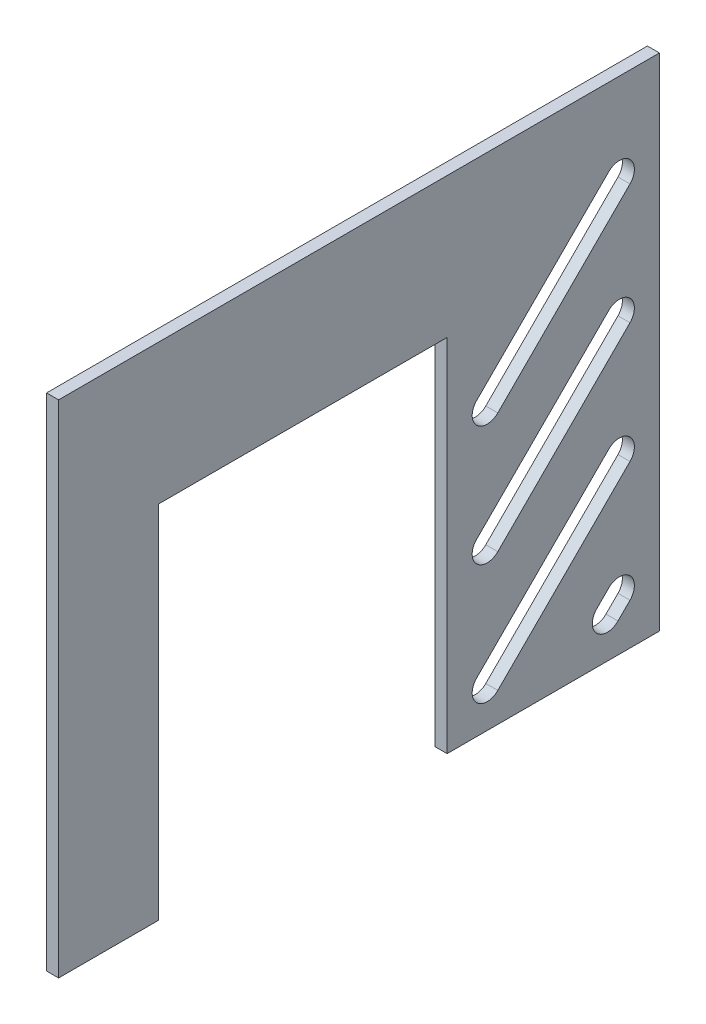
ISO-10303-21;
HEADER;
FILE_DESCRIPTION(('STEP AP214'),'2;1');
FILE_NAME('part.step','',(''),(''),'','','');
FILE_SCHEMA(('AUTOMOTIVE_DESIGN { 1 0 10303 214 1 1 1 1 }'));
ENDSEC;
DATA;
#1=APPLICATION_CONTEXT('core data for automotive mechanical design processes');
#2=APPLICATION_PROTOCOL_DEFINITION('international standard','automotive_design',2000,#1);
#3=PRODUCT_CONTEXT('',#1,'mechanical');
#4=PRODUCT('Part','Part','',(#3));
#5=PRODUCT_RELATED_PRODUCT_CATEGORY('part','',(#4));
#6=PRODUCT_DEFINITION_FORMATION('','',#4);
#7=PRODUCT_DEFINITION_CONTEXT('part definition',#1,'design');
#8=PRODUCT_DEFINITION('design','',#6,#7);
#9=PRODUCT_DEFINITION_SHAPE('','',#8);
#10=(LENGTH_UNIT() NAMED_UNIT(*) SI_UNIT(.MILLI.,.METRE.));
#11=(NAMED_UNIT(*) PLANE_ANGLE_UNIT() SI_UNIT($,.RADIAN.));
#12=(NAMED_UNIT(*) SI_UNIT($,.STERADIAN.) SOLID_ANGLE_UNIT());
#13=UNCERTAINTY_MEASURE_WITH_UNIT(LENGTH_MEASURE(1.E-05),#10,'distance_accuracy_value','');
#14=(GEOMETRIC_REPRESENTATION_CONTEXT(3) GLOBAL_UNCERTAINTY_ASSIGNED_CONTEXT((#13)) GLOBAL_UNIT_ASSIGNED_CONTEXT((#10,
#11,#12)) REPRESENTATION_CONTEXT('',''));
#15=CARTESIAN_POINT('',(0.,0.,0.));
#16=DIRECTION('',(0.,0.,1.));
#17=DIRECTION('',(1.,0.,0.));
#18=AXIS2_PLACEMENT_3D('',#15,#16,#17);
#19=CARTESIAN_POINT('',(6.,0.,0.));
#20=DIRECTION('',(0.,-1.,0.));
#21=DIRECTION('',(0.,0.,-1.));
#22=AXIS2_PLACEMENT_3D('',#19,#20,#21);
#23=PLANE('',#22);
#24=DIRECTION('',(0.,0.,1.));
#25=VECTOR('',#24,1.);
#26=CARTESIAN_POINT('',(0.,0.,0.));
#27=LINE('',#26,#25);
#28=CARTESIAN_POINT('',(0.,0.,-300.));
#29=VERTEX_POINT('',#28);
#30=CARTESIAN_POINT('',(0.,0.,-194.));
#31=VERTEX_POINT('',#30);
#32=EDGE_CURVE('E315',#29,#31,#27,.T.);
#33=ORIENTED_EDGE('',*,*,#32,.F.);
#34=DIRECTION('',(-1.,0.,0.));
#35=VECTOR('',#34,1.);
#36=CARTESIAN_POINT('',(6.,0.,-300.));
#37=LINE('',#36,#35);
#38=CARTESIAN_POINT('',(6.,0.,-300.));
#39=VERTEX_POINT('',#38);
#40=EDGE_CURVE('E11',#39,#29,#37,.T.);
#41=ORIENTED_EDGE('',*,*,#40,.F.);
#42=DIRECTION('',(0.,0.,1.));
#43=VECTOR('',#42,1.);
#44=CARTESIAN_POINT('',(6.,0.,0.));
#45=LINE('',#44,#43);
#46=CARTESIAN_POINT('',(6.,0.,-194.));
#47=VERTEX_POINT('',#46);
#48=EDGE_CURVE('E316',#39,#47,#45,.T.);
#49=ORIENTED_EDGE('',*,*,#48,.T.);
#50=DIRECTION('',(-1.,0.,0.));
#51=VECTOR('',#50,1.);
#52=CARTESIAN_POINT('',(6.,0.,-194.));
#53=LINE('',#52,#51);
#54=EDGE_CURVE('E339',#47,#31,#53,.T.);
#55=ORIENTED_EDGE('',*,*,#54,.T.);
#56=EDGE_LOOP('',(#33,#41,#49,#55));
#57=FACE_BOUND('',#56,.T.);
#58=ADVANCED_FACE('F40',(#57),#23,.T.);
#59=CARTESIAN_POINT('',(6.,0.,-300.));
#60=DIRECTION('',(0.,0.,1.));
#61=DIRECTION('',(1.,0.,0.));
#62=AXIS2_PLACEMENT_3D('',#59,#60,#61);
#63=PLANE('',#62);
#64=DIRECTION('',(-1.,0.,0.));
#65=VECTOR('',#64,1.);
#66=CARTESIAN_POINT('',(6.,250.,-300.));
#67=LINE('',#66,#65);
#68=CARTESIAN_POINT('',(6.,250.,-300.));
#69=VERTEX_POINT('',#68);
#70=CARTESIAN_POINT('',(0.,250.,-300.));
#71=VERTEX_POINT('',#70);
#72=EDGE_CURVE('E47',#69,#71,#67,.T.);
#73=ORIENTED_EDGE('',*,*,#72,.F.);
#74=DIRECTION('',(0.,1.,0.));
#75=VECTOR('',#74,1.);
#76=CARTESIAN_POINT('',(6.,0.,-300.));
#77=LINE('',#76,#75);
#78=EDGE_CURVE('E319',#39,#69,#77,.T.);
#79=ORIENTED_EDGE('',*,*,#78,.F.);
#80=ORIENTED_EDGE('',*,*,#40,.T.);
#81=DIRECTION('',(0.,1.,0.));
#82=VECTOR('',#81,1.);
#83=CARTESIAN_POINT('',(0.,0.,-300.));
#84=LINE('',#83,#82);
#85=EDGE_CURVE('E342',#29,#71,#84,.T.);
#86=ORIENTED_EDGE('',*,*,#85,.T.);
#87=EDGE_LOOP('',(#73,#79,#80,#86));
#88=FACE_BOUND('',#87,.T.);
#89=ADVANCED_FACE('F394',(#88),#63,.F.);
#90=CARTESIAN_POINT('',(6.,250.,0.));
#91=DIRECTION('',(0.,1.,0.));
#92=DIRECTION('',(0.,0.,1.));
#93=AXIS2_PLACEMENT_3D('',#90,#91,#92);
#94=PLANE('',#93);
#95=DIRECTION('',(0.,0.,-1.));
#96=VECTOR('',#95,1.);
#97=CARTESIAN_POINT('',(0.,250.,0.));
#98=LINE('',#97,#96);
#99=CARTESIAN_POINT('',(0.,250.,0.));
#100=VERTEX_POINT('',#99);
#101=EDGE_CURVE('E344',#100,#71,#98,.T.);
#102=ORIENTED_EDGE('',*,*,#101,.F.);
#103=DIRECTION('',(-1.,0.,0.));
#104=VECTOR('',#103,1.);
#105=CARTESIAN_POINT('',(6.,250.,0.));
#106=LINE('',#105,#104);
#107=CARTESIAN_POINT('',(6.,250.,0.));
#108=VERTEX_POINT('',#107);
#109=EDGE_CURVE('E373',#108,#100,#106,.T.);
#110=ORIENTED_EDGE('',*,*,#109,.F.);
#111=DIRECTION('',(0.,0.,-1.));
#112=VECTOR('',#111,1.);
#113=CARTESIAN_POINT('',(6.,250.,0.));
#114=LINE('',#113,#112);
#115=EDGE_CURVE('E322',#108,#69,#114,.T.);
#116=ORIENTED_EDGE('',*,*,#115,.T.);
#117=ORIENTED_EDGE('',*,*,#72,.T.);
#118=EDGE_LOOP('',(#102,#110,#116,#117));
#119=FACE_BOUND('',#118,.T.);
#120=ADVANCED_FACE('F378',(#119),#94,.T.);
#121=CARTESIAN_POINT('',(6.,0.,0.));
#122=DIRECTION('',(0.,0.,1.));
#123=DIRECTION('',(1.,0.,0.));
#124=AXIS2_PLACEMENT_3D('',#121,#122,#123);
#125=PLANE('',#124);
#126=DIRECTION('',(0.,1.,0.));
#127=VECTOR('',#126,1.);
#128=CARTESIAN_POINT('',(0.,0.,0.));
#129=LINE('',#128,#127);
#130=CARTESIAN_POINT('',(0.,0.,0.));
#131=VERTEX_POINT('',#130);
#132=EDGE_CURVE('E347',#131,#100,#129,.T.);
#133=ORIENTED_EDGE('',*,*,#132,.F.);
#134=DIRECTION('',(-1.,0.,0.));
#135=VECTOR('',#134,1.);
#136=CARTESIAN_POINT('',(6.,0.,0.));
#137=LINE('',#136,#135);
#138=CARTESIAN_POINT('',(6.,0.,0.));
#139=VERTEX_POINT('',#138);
#140=EDGE_CURVE('E371',#139,#131,#137,.T.);
#141=ORIENTED_EDGE('',*,*,#140,.F.);
#142=DIRECTION('',(0.,1.,0.));
#143=VECTOR('',#142,1.);
#144=CARTESIAN_POINT('',(6.,0.,0.));
#145=LINE('',#144,#143);
#146=EDGE_CURVE('E325',#139,#108,#145,.T.);
#147=ORIENTED_EDGE('',*,*,#146,.T.);
#148=ORIENTED_EDGE('',*,*,#109,.T.);
#149=EDGE_LOOP('',(#133,#141,#147,#148));
#150=FACE_BOUND('',#149,.T.);
#151=ADVANCED_FACE('F389',(#150),#125,.T.);
#152=CARTESIAN_POINT('',(6.,0.,0.));
#153=DIRECTION('',(0.,1.,0.));
#154=DIRECTION('',(0.,0.,1.));
#155=AXIS2_PLACEMENT_3D('',#152,#153,#154);
#156=PLANE('',#155);
#157=DIRECTION('',(0.,0.,-1.));
#158=VECTOR('',#157,1.);
#159=CARTESIAN_POINT('',(0.,0.,0.));
#160=LINE('',#159,#158);
#161=CARTESIAN_POINT('',(0.,0.,-50.));
#162=VERTEX_POINT('',#161);
#163=EDGE_CURVE('E350',#131,#162,#160,.T.);
#164=ORIENTED_EDGE('',*,*,#163,.T.);
#165=DIRECTION('',(-1.,0.,0.));
#166=VECTOR('',#165,1.);
#167=CARTESIAN_POINT('',(6.,0.,-50.));
#168=LINE('',#167,#166);
#169=CARTESIAN_POINT('',(6.,0.,-50.));
#170=VERTEX_POINT('',#169);
#171=EDGE_CURVE('E368',#170,#162,#168,.T.);
#172=ORIENTED_EDGE('',*,*,#171,.F.);
#173=DIRECTION('',(0.,0.,-1.));
#174=VECTOR('',#173,1.);
#175=CARTESIAN_POINT('',(6.,0.,0.));
#176=LINE('',#175,#174);
#177=EDGE_CURVE('E328',#139,#170,#176,.T.);
#178=ORIENTED_EDGE('',*,*,#177,.F.);
#179=ORIENTED_EDGE('',*,*,#140,.T.);
#180=EDGE_LOOP('',(#164,#172,#178,#179));
#181=FACE_BOUND('',#180,.T.);
#182=ADVANCED_FACE('F407',(#181),#156,.F.);
#183=CARTESIAN_POINT('',(6.,0.,-50.));
#184=DIRECTION('',(0.,0.,1.));
#185=DIRECTION('',(1.,0.,0.));
#186=AXIS2_PLACEMENT_3D('',#183,#184,#185);
#187=PLANE('',#186);
#188=DIRECTION('',(0.,1.,0.));
#189=VECTOR('',#188,1.);
#190=CARTESIAN_POINT('',(0.,0.,-50.));
#191=LINE('',#190,#189);
#192=CARTESIAN_POINT('',(0.,180.,-50.));
#193=VERTEX_POINT('',#192);
#194=EDGE_CURVE('E353',#162,#193,#191,.T.);
#195=ORIENTED_EDGE('',*,*,#194,.T.);
#196=DIRECTION('',(-1.,0.,0.));
#197=VECTOR('',#196,1.);
#198=CARTESIAN_POINT('',(6.,180.,-50.));
#199=LINE('',#198,#197);
#200=CARTESIAN_POINT('',(6.,180.,-50.));
#201=VERTEX_POINT('',#200);
#202=EDGE_CURVE('E365',#201,#193,#199,.T.);
#203=ORIENTED_EDGE('',*,*,#202,.F.);
#204=DIRECTION('',(0.,1.,0.));
#205=VECTOR('',#204,1.);
#206=CARTESIAN_POINT('',(6.,0.,-50.));
#207=LINE('',#206,#205);
#208=EDGE_CURVE('E331',#170,#201,#207,.T.);
#209=ORIENTED_EDGE('',*,*,#208,.F.);
#210=ORIENTED_EDGE('',*,*,#171,.T.);
#211=EDGE_LOOP('',(#195,#203,#209,#210));
#212=FACE_BOUND('',#211,.T.);
#213=ADVANCED_FACE('F404',(#212),#187,.F.);
#214=CARTESIAN_POINT('',(6.,180.,0.));
#215=DIRECTION('',(0.,1.,0.));
#216=DIRECTION('',(0.,0.,1.));
#217=AXIS2_PLACEMENT_3D('',#214,#215,#216);
#218=PLANE('',#217);
#219=DIRECTION('',(0.,0.,-1.));
#220=VECTOR('',#219,1.);
#221=CARTESIAN_POINT('',(0.,180.,0.));
#222=LINE('',#221,#220);
#223=CARTESIAN_POINT('',(0.,180.,-194.));
#224=VERTEX_POINT('',#223);
#225=EDGE_CURVE('E356',#193,#224,#222,.T.);
#226=ORIENTED_EDGE('',*,*,#225,.T.);
#227=DIRECTION('',(-1.,0.,0.));
#228=VECTOR('',#227,1.);
#229=CARTESIAN_POINT('',(6.,180.,-194.));
#230=LINE('',#229,#228);
#231=CARTESIAN_POINT('',(6.,180.,-194.));
#232=VERTEX_POINT('',#231);
#233=EDGE_CURVE('E362',#232,#224,#230,.T.);
#234=ORIENTED_EDGE('',*,*,#233,.F.);
#235=DIRECTION('',(0.,0.,-1.));
#236=VECTOR('',#235,1.);
#237=CARTESIAN_POINT('',(6.,180.,0.));
#238=LINE('',#237,#236);
#239=EDGE_CURVE('E334',#201,#232,#238,.T.);
#240=ORIENTED_EDGE('',*,*,#239,.F.);
#241=ORIENTED_EDGE('',*,*,#202,.T.);
#242=EDGE_LOOP('',(#226,#234,#240,#241));
#243=FACE_BOUND('',#242,.T.);
#244=ADVANCED_FACE('F401',(#243),#218,.F.);
#245=CARTESIAN_POINT('',(6.,0.,-194.));
#246=DIRECTION('',(0.,0.,-1.));
#247=DIRECTION('',(0.,1.,0.));
#248=AXIS2_PLACEMENT_3D('',#245,#246,#247);
#249=PLANE('',#248);
#250=DIRECTION('',(0.,-1.,0.));
#251=VECTOR('',#250,1.);
#252=CARTESIAN_POINT('',(0.,0.,-194.));
#253=LINE('',#252,#251);
#254=EDGE_CURVE('E320',#224,#31,#253,.T.);
#255=ORIENTED_EDGE('',*,*,#254,.T.);
#256=ORIENTED_EDGE('',*,*,#54,.F.);
#257=DIRECTION('',(0.,-1.,0.));
#258=VECTOR('',#257,1.);
#259=CARTESIAN_POINT('',(6.,0.,-194.));
#260=LINE('',#259,#258);
#261=EDGE_CURVE('E337',#232,#47,#260,.T.);
#262=ORIENTED_EDGE('',*,*,#261,.F.);
#263=ORIENTED_EDGE('',*,*,#233,.T.);
#264=EDGE_LOOP('',(#255,#256,#262,#263));
#265=FACE_BOUND('',#264,.T.);
#266=ADVANCED_FACE('F399',(#265),#249,.F.);
#267=CARTESIAN_POINT('',(6.,0.,0.));
#268=DIRECTION('',(1.,0.,0.));
#269=DIRECTION('',(0.,0.,-1.));
#270=AXIS2_PLACEMENT_3D('',#267,#268,#269);
#271=PLANE('',#270);
#272=CARTESIAN_POINT('',(6.,140.,-214.));
#273=DIRECTION('',(1.,0.,0.));
#274=DIRECTION('',(0.,0.,-1.));
#275=AXIS2_PLACEMENT_3D('',#272,#273,#274);
#276=CIRCLE('',#275,7.50000000000002);
#277=CARTESIAN_POINT('',(6.,145.303300858899,-208.696699141101));
#278=VERTEX_POINT('',#277);
#279=CARTESIAN_POINT('',(6.,134.696699141101,-219.303300858899));
#280=VERTEX_POINT('',#279);
#281=EDGE_CURVE('E212',#278,#280,#276,.T.);
#282=ORIENTED_EDGE('',*,*,#281,.F.);
#283=DIRECTION('',(0.,-0.707106781186547,0.707106781186548));
#284=VECTOR('',#283,1.);
#285=CARTESIAN_POINT('',(6.,28.3033008588991,-91.6966991411008));
#286=LINE('',#285,#284);
#287=CARTESIAN_POINT('',(6.,211.303300858899,-274.696699141101));
#288=VERTEX_POINT('',#287);
#289=EDGE_CURVE('E201',#288,#278,#286,.T.);
#290=ORIENTED_EDGE('',*,*,#289,.F.);
#291=CARTESIAN_POINT('',(6.,206.,-280.));
#292=DIRECTION('',(1.,0.,0.));
#293=DIRECTION('',(0.,0.,-1.));
#294=AXIS2_PLACEMENT_3D('',#291,#292,#293);
#295=CIRCLE('',#294,7.5);
#296=CARTESIAN_POINT('',(6.,200.696699141101,-285.303300858899));
#297=VERTEX_POINT('',#296);
#298=EDGE_CURVE('E54',#297,#288,#295,.T.);
#299=ORIENTED_EDGE('',*,*,#298,.F.);
#300=DIRECTION('',(0.,0.707106781186548,-0.707106781186548));
#301=VECTOR('',#300,1.);
#302=CARTESIAN_POINT('',(6.,17.6966991411009,-102.303300858899));
#303=LINE('',#302,#301);
#304=EDGE_CURVE('E218',#280,#297,#303,.T.);
#305=ORIENTED_EDGE('',*,*,#304,.F.);
#306=EDGE_LOOP('',(#282,#290,#299,#305));
#307=FACE_BOUND('',#306,.T.);
#308=DIRECTION('',(0.,0.707106781186549,-0.707106781186546));
#309=VECTOR('',#308,1.);
#310=CARTESIAN_POINT('',(6.,-12.3033008588991,-132.3033008589));
#311=LINE('',#310,#309);
#312=CARTESIAN_POINT('',(6.,74.6966991411009,-219.303300858899));
#313=VERTEX_POINT('',#312);
#314=CARTESIAN_POINT('',(6.,140.696699141101,-285.303300858899));
#315=VERTEX_POINT('',#314);
#316=EDGE_CURVE('E252',#313,#315,#311,.T.);
#317=ORIENTED_EDGE('',*,*,#316,.F.);
#318=CARTESIAN_POINT('',(6.,80.,-214.));
#319=DIRECTION('',(1.,0.,0.));
#320=DIRECTION('',(0.,0.,-1.));
#321=AXIS2_PLACEMENT_3D('',#318,#319,#320);
#322=CIRCLE('',#321,7.50000000000002);
#323=CARTESIAN_POINT('',(6.,85.3033008588991,-208.696699141101));
#324=VERTEX_POINT('',#323);
#325=EDGE_CURVE('E232',#324,#313,#322,.T.);
#326=ORIENTED_EDGE('',*,*,#325,.F.);
#327=DIRECTION('',(0.,-0.707106781186549,0.707106781186546));
#328=VECTOR('',#327,1.);
#329=CARTESIAN_POINT('',(6.,-1.69669914110089,-121.696699141101));
#330=LINE('',#329,#328);
#331=CARTESIAN_POINT('',(6.,151.303300858899,-274.696699141101));
#332=VERTEX_POINT('',#331);
#333=EDGE_CURVE('E238',#332,#324,#330,.T.);
#334=ORIENTED_EDGE('',*,*,#333,.F.);
#335=CARTESIAN_POINT('',(6.,146.,-280.));
#336=DIRECTION('',(1.,0.,0.));
#337=DIRECTION('',(0.,0.,-1.));
#338=AXIS2_PLACEMENT_3D('',#335,#336,#337);
#339=CIRCLE('',#338,7.50000000000006);
#340=EDGE_CURVE('E245',#315,#332,#339,.T.);
#341=ORIENTED_EDGE('',*,*,#340,.F.);
#342=EDGE_LOOP('',(#317,#326,#334,#341));
#343=FACE_BOUND('',#342,.T.);
#344=CARTESIAN_POINT('',(6.,20.,-274.));
#345=DIRECTION('',(1.,0.,0.));
#346=DIRECTION('',(0.,0.,-1.));
#347=AXIS2_PLACEMENT_3D('',#344,#345,#346);
#348=CIRCLE('',#347,7.50000000000006);
#349=CARTESIAN_POINT('',(6.,25.3033008588992,-268.696699141101));
#350=VERTEX_POINT('',#349);
#351=CARTESIAN_POINT('',(6.,14.6966991411009,-279.303300858899));
#352=VERTEX_POINT('',#351);
#353=EDGE_CURVE('E313',#350,#352,#348,.T.);
#354=ORIENTED_EDGE('',*,*,#353,.F.);
#355=DIRECTION('',(0.,-0.707106781186549,0.707106781186546));
#356=VECTOR('',#355,1.);
#357=CARTESIAN_POINT('',(6.,-121.696699141101,-121.696699141101));
#358=LINE('',#357,#356);
#359=CARTESIAN_POINT('',(6.,31.3033008588992,-274.696699141101));
#360=VERTEX_POINT('',#359);
#361=EDGE_CURVE('E306',#360,#350,#358,.T.);
#362=ORIENTED_EDGE('',*,*,#361,.F.);
#363=CARTESIAN_POINT('',(6.,26.,-280.));
#364=DIRECTION('',(1.,0.,0.));
#365=DIRECTION('',(0.,0.,-1.));
#366=AXIS2_PLACEMENT_3D('',#363,#364,#365);
#367=CIRCLE('',#366,7.50000000000006);
#368=CARTESIAN_POINT('',(6.,20.6966991411009,-285.303300858899));
#369=VERTEX_POINT('',#368);
#370=EDGE_CURVE('E308',#369,#360,#367,.T.);
#371=ORIENTED_EDGE('',*,*,#370,.F.);
#372=DIRECTION('',(0.,0.707106781186549,-0.707106781186546));
#373=VECTOR('',#372,1.);
#374=CARTESIAN_POINT('',(6.,-132.303300858899,-132.3033008589));
#375=LINE('',#374,#373);
#376=EDGE_CURVE('E311',#352,#369,#375,.T.);
#377=ORIENTED_EDGE('',*,*,#376,.F.);
#378=EDGE_LOOP('',(#354,#362,#371,#377));
#379=FACE_BOUND('',#378,.T.);
#380=CARTESIAN_POINT('',(6.,20.,-214.));
#381=DIRECTION('',(1.,0.,0.));
#382=DIRECTION('',(0.,0.,-1.));
#383=AXIS2_PLACEMENT_3D('',#380,#381,#382);
#384=CIRCLE('',#383,7.50000000000002);
#385=CARTESIAN_POINT('',(6.,25.3033008588991,-208.696699141101));
#386=VERTEX_POINT('',#385);
#387=CARTESIAN_POINT('',(6.,14.6966991411009,-219.303300858899));
#388=VERTEX_POINT('',#387);
#389=EDGE_CURVE('E304',#386,#388,#384,.T.);
#390=ORIENTED_EDGE('',*,*,#389,.F.);
#391=DIRECTION('',(0.,-0.707106781186547,0.707106781186548));
#392=VECTOR('',#391,1.);
#393=CARTESIAN_POINT('',(6.,-91.6966991411009,-91.6966991411008));
#394=LINE('',#393,#392);
#395=CARTESIAN_POINT('',(6.,91.3033008588991,-274.696699141101));
#396=VERTEX_POINT('',#395);
#397=EDGE_CURVE('E290',#396,#386,#394,.T.);
#398=ORIENTED_EDGE('',*,*,#397,.F.);
#399=CARTESIAN_POINT('',(6.,86.,-280.));
#400=DIRECTION('',(1.,0.,0.));
#401=DIRECTION('',(0.,0.,-1.));
#402=AXIS2_PLACEMENT_3D('',#399,#400,#401);
#403=CIRCLE('',#402,7.5);
#404=CARTESIAN_POINT('',(6.,80.6966991411009,-285.303300858899));
#405=VERTEX_POINT('',#404);
#406=EDGE_CURVE('E299',#405,#396,#403,.T.);
#407=ORIENTED_EDGE('',*,*,#406,.F.);
#408=DIRECTION('',(0.,0.707106781186548,-0.707106781186548));
#409=VECTOR('',#408,1.);
#410=CARTESIAN_POINT('',(6.,-102.303300858899,-102.303300858899));
#411=LINE('',#410,#409);
#412=EDGE_CURVE('E302',#388,#405,#411,.T.);
#413=ORIENTED_EDGE('',*,*,#412,.F.);
#414=EDGE_LOOP('',(#390,#398,#407,#413));
#415=FACE_BOUND('',#414,.T.);
#416=ORIENTED_EDGE('',*,*,#261,.T.);
#417=ORIENTED_EDGE('',*,*,#48,.F.);
#418=ORIENTED_EDGE('',*,*,#78,.T.);
#419=ORIENTED_EDGE('',*,*,#115,.F.);
#420=ORIENTED_EDGE('',*,*,#146,.F.);
#421=ORIENTED_EDGE('',*,*,#177,.T.);
#422=ORIENTED_EDGE('',*,*,#208,.T.);
#423=ORIENTED_EDGE('',*,*,#239,.T.);
#424=EDGE_LOOP('',(#416,#417,#418,#419,#420,#421,#422,#423));
#425=FACE_BOUND('',#424,.T.);
#426=ADVANCED_FACE('F215',(#307,#343,#379,#415,#425),#271,.T.);
#427=CARTESIAN_POINT('',(0.,0.,0.));
#428=DIRECTION('',(1.,0.,0.));
#429=DIRECTION('',(0.,0.,-1.));
#430=AXIS2_PLACEMENT_3D('',#427,#428,#429);
#431=PLANE('',#430);
#432=DIRECTION('',(0.,0.707106781186547,-0.707106781186548));
#433=VECTOR('',#432,1.);
#434=CARTESIAN_POINT('',(0.,145.303300858899,-208.696699141101));
#435=LINE('',#434,#433);
#436=CARTESIAN_POINT('',(0.,145.303300858899,-208.696699141101));
#437=VERTEX_POINT('',#436);
#438=CARTESIAN_POINT('',(0.,211.303300858899,-274.696699141101));
#439=VERTEX_POINT('',#438);
#440=EDGE_CURVE('E208',#437,#439,#435,.T.);
#441=ORIENTED_EDGE('',*,*,#440,.F.);
#442=CARTESIAN_POINT('',(0.,140.,-214.));
#443=DIRECTION('',(-1.,0.,0.));
#444=DIRECTION('',(0.,0.,1.));
#445=AXIS2_PLACEMENT_3D('',#442,#443,#444);
#446=CIRCLE('',#445,7.50000000000002);
#447=CARTESIAN_POINT('',(0.,134.696699141101,-219.303300858899));
#448=VERTEX_POINT('',#447);
#449=EDGE_CURVE('E62',#448,#437,#446,.T.);
#450=ORIENTED_EDGE('',*,*,#449,.F.);
#451=DIRECTION('',(0.,-0.707106781186547,0.707106781186547));
#452=VECTOR('',#451,1.);
#453=CARTESIAN_POINT('',(0.,134.696699141101,-219.303300858899));
#454=LINE('',#453,#452);
#455=CARTESIAN_POINT('',(0.,200.696699141101,-285.303300858899));
#456=VERTEX_POINT('',#455);
#457=EDGE_CURVE('E223',#456,#448,#454,.T.);
#458=ORIENTED_EDGE('',*,*,#457,.F.);
#459=CARTESIAN_POINT('',(0.,206.,-280.));
#460=DIRECTION('',(-1.,0.,0.));
#461=DIRECTION('',(0.,0.,1.));
#462=AXIS2_PLACEMENT_3D('',#459,#460,#461);
#463=CIRCLE('',#462,7.5);
#464=EDGE_CURVE('E755',#439,#456,#463,.T.);
#465=ORIENTED_EDGE('',*,*,#464,.F.);
#466=EDGE_LOOP('',(#441,#450,#458,#465));
#467=FACE_BOUND('',#466,.T.);
#468=CARTESIAN_POINT('',(0.,80.,-214.));
#469=DIRECTION('',(-1.,0.,0.));
#470=DIRECTION('',(0.,0.,1.));
#471=AXIS2_PLACEMENT_3D('',#468,#469,#470);
#472=CIRCLE('',#471,7.50000000000002);
#473=CARTESIAN_POINT('',(0.,74.6966991411009,-219.303300858899));
#474=VERTEX_POINT('',#473);
#475=CARTESIAN_POINT('',(0.,85.3033008588992,-208.696699141101));
#476=VERTEX_POINT('',#475);
#477=EDGE_CURVE('E235',#474,#476,#472,.T.);
#478=ORIENTED_EDGE('',*,*,#477,.F.);
#479=DIRECTION('',(0.,-0.707106781186549,0.707106781186546));
#480=VECTOR('',#479,1.);
#481=CARTESIAN_POINT('',(0.,134.696699141101,-279.303300858899));
#482=LINE('',#481,#480);
#483=CARTESIAN_POINT('',(0.,140.696699141101,-285.303300858899));
#484=VERTEX_POINT('',#483);
#485=EDGE_CURVE('E255',#484,#474,#482,.T.);
#486=ORIENTED_EDGE('',*,*,#485,.F.);
#487=CARTESIAN_POINT('',(0.,146.,-280.));
#488=DIRECTION('',(-1.,0.,0.));
#489=DIRECTION('',(0.,0.,1.));
#490=AXIS2_PLACEMENT_3D('',#487,#488,#489);
#491=CIRCLE('',#490,7.50000000000006);
#492=CARTESIAN_POINT('',(0.,151.303300858899,-274.696699141101));
#493=VERTEX_POINT('',#492);
#494=EDGE_CURVE('E247',#493,#484,#491,.T.);
#495=ORIENTED_EDGE('',*,*,#494,.F.);
#496=DIRECTION('',(0.,0.707106781186549,-0.707106781186546));
#497=VECTOR('',#496,1.);
#498=CARTESIAN_POINT('',(0.,145.303300858899,-268.696699141101));
#499=LINE('',#498,#497);
#500=EDGE_CURVE('E240',#476,#493,#499,.T.);
#501=ORIENTED_EDGE('',*,*,#500,.F.);
#502=EDGE_LOOP('',(#478,#486,#495,#501));
#503=FACE_BOUND('',#502,.T.);
#504=DIRECTION('',(0.,0.707106781186549,-0.707106781186546));
#505=VECTOR('',#504,1.);
#506=CARTESIAN_POINT('',(0.,25.3033008588992,-268.696699141101));
#507=LINE('',#506,#505);
#508=CARTESIAN_POINT('',(0.,25.3033008588991,-268.696699141101));
#509=VERTEX_POINT('',#508);
#510=CARTESIAN_POINT('',(0.,31.3033008588992,-274.696699141101));
#511=VERTEX_POINT('',#510);
#512=EDGE_CURVE('E259',#509,#511,#507,.T.);
#513=ORIENTED_EDGE('',*,*,#512,.F.);
#514=CARTESIAN_POINT('',(0.,20.,-274.));
#515=DIRECTION('',(-1.,0.,0.));
#516=DIRECTION('',(0.,0.,1.));
#517=AXIS2_PLACEMENT_3D('',#514,#515,#516);
#518=CIRCLE('',#517,7.50000000000006);
#519=CARTESIAN_POINT('',(0.,14.6966991411009,-279.303300858899));
#520=VERTEX_POINT('',#519);
#521=EDGE_CURVE('E257',#520,#509,#518,.T.);
#522=ORIENTED_EDGE('',*,*,#521,.F.);
#523=DIRECTION('',(0.,-0.707106781186549,0.707106781186546));
#524=VECTOR('',#523,1.);
#525=CARTESIAN_POINT('',(0.,14.6966991411009,-279.303300858899));
#526=LINE('',#525,#524);
#527=CARTESIAN_POINT('',(0.,20.6966991411009,-285.303300858899));
#528=VERTEX_POINT('',#527);
#529=EDGE_CURVE('E265',#528,#520,#526,.T.);
#530=ORIENTED_EDGE('',*,*,#529,.F.);
#531=CARTESIAN_POINT('',(0.,26.,-280.));
#532=DIRECTION('',(-1.,0.,0.));
#533=DIRECTION('',(0.,0.,1.));
#534=AXIS2_PLACEMENT_3D('',#531,#532,#533);
#535=CIRCLE('',#534,7.50000000000006);
#536=EDGE_CURVE('E262',#511,#528,#535,.T.);
#537=ORIENTED_EDGE('',*,*,#536,.F.);
#538=EDGE_LOOP('',(#513,#522,#530,#537));
#539=FACE_BOUND('',#538,.T.);
#540=DIRECTION('',(0.,0.707106781186547,-0.707106781186548));
#541=VECTOR('',#540,1.);
#542=CARTESIAN_POINT('',(0.,25.3033008588991,-208.696699141101));
#543=LINE('',#542,#541);
#544=CARTESIAN_POINT('',(0.,25.3033008588992,-208.696699141101));
#545=VERTEX_POINT('',#544);
#546=CARTESIAN_POINT('',(0.,91.3033008588991,-274.696699141101));
#547=VERTEX_POINT('',#546);
#548=EDGE_CURVE('E279',#545,#547,#543,.T.);
#549=ORIENTED_EDGE('',*,*,#548,.F.);
#550=CARTESIAN_POINT('',(0.,20.,-214.));
#551=DIRECTION('',(-1.,0.,0.));
#552=DIRECTION('',(0.,0.,1.));
#553=AXIS2_PLACEMENT_3D('',#550,#551,#552);
#554=CIRCLE('',#553,7.50000000000002);
#555=CARTESIAN_POINT('',(0.,14.6966991411009,-219.303300858899));
#556=VERTEX_POINT('',#555);
#557=EDGE_CURVE('E271',#556,#545,#554,.T.);
#558=ORIENTED_EDGE('',*,*,#557,.F.);
#559=DIRECTION('',(0.,-0.707106781186547,0.707106781186547));
#560=VECTOR('',#559,1.);
#561=CARTESIAN_POINT('',(0.,14.6966991411009,-219.303300858899));
#562=LINE('',#561,#560);
#563=CARTESIAN_POINT('',(0.,80.6966991411009,-285.303300858899));
#564=VERTEX_POINT('',#563);
#565=EDGE_CURVE('E284',#564,#556,#562,.T.);
#566=ORIENTED_EDGE('',*,*,#565,.F.);
#567=CARTESIAN_POINT('',(0.,86.,-280.));
#568=DIRECTION('',(-1.,0.,0.));
#569=DIRECTION('',(0.,0.,1.));
#570=AXIS2_PLACEMENT_3D('',#567,#568,#569);
#571=CIRCLE('',#570,7.5);
#572=EDGE_CURVE('E281',#547,#564,#571,.T.);
#573=ORIENTED_EDGE('',*,*,#572,.F.);
#574=EDGE_LOOP('',(#549,#558,#566,#573));
#575=FACE_BOUND('',#574,.T.);
#576=ORIENTED_EDGE('',*,*,#101,.T.);
#577=ORIENTED_EDGE('',*,*,#85,.F.);
#578=ORIENTED_EDGE('',*,*,#32,.T.);
#579=ORIENTED_EDGE('',*,*,#254,.F.);
#580=ORIENTED_EDGE('',*,*,#225,.F.);
#581=ORIENTED_EDGE('',*,*,#194,.F.);
#582=ORIENTED_EDGE('',*,*,#163,.F.);
#583=ORIENTED_EDGE('',*,*,#132,.T.);
#584=EDGE_LOOP('',(#576,#577,#578,#579,#580,#581,#582,#583));
#585=FACE_BOUND('',#584,.T.);
#586=ADVANCED_FACE('F384',(#467,#503,#539,#575,#585),#431,.F.);
#587=CARTESIAN_POINT('',(10.,20.,-214.));
#588=DIRECTION('',(-1.,0.,0.));
#589=DIRECTION('',(0.,0.,1.));
#590=AXIS2_PLACEMENT_3D('',#587,#588,#589);
#591=CYLINDRICAL_SURFACE('',#590,7.50000000000002);
#592=ORIENTED_EDGE('',*,*,#389,.T.);
#593=DIRECTION('',(-1.,0.,0.));
#594=VECTOR('',#593,1.);
#595=CARTESIAN_POINT('',(10.,14.6966991411009,-219.303300858899));
#596=LINE('',#595,#594);
#597=EDGE_CURVE('E287',#388,#556,#596,.T.);
#598=ORIENTED_EDGE('',*,*,#597,.T.);
#599=ORIENTED_EDGE('',*,*,#557,.T.);
#600=DIRECTION('',(-1.,0.,0.));
#601=VECTOR('',#600,1.);
#602=CARTESIAN_POINT('',(10.,25.3033008588991,-208.696699141101));
#603=LINE('',#602,#601);
#604=EDGE_CURVE('E286',#386,#545,#603,.T.);
#605=ORIENTED_EDGE('',*,*,#604,.F.);
#606=EDGE_LOOP('',(#592,#598,#599,#605));
#607=FACE_BOUND('',#606,.T.);
#608=ADVANCED_FACE('F449',(#607),#591,.F.);
#609=CARTESIAN_POINT('',(10.,14.6966991411009,-219.303300858899));
#610=DIRECTION('',(0.,-0.707106781186548,-0.707106781186548));
#611=DIRECTION('',(0.,0.707106781186548,-0.707106781186548));
#612=AXIS2_PLACEMENT_3D('',#609,#610,#611);
#613=PLANE('',#612);
#614=ORIENTED_EDGE('',*,*,#412,.T.);
#615=DIRECTION('',(-1.,0.,0.));
#616=VECTOR('',#615,1.);
#617=CARTESIAN_POINT('',(10.,80.6966991411009,-285.303300858899));
#618=LINE('',#617,#616);
#619=EDGE_CURVE('E291',#405,#564,#618,.T.);
#620=ORIENTED_EDGE('',*,*,#619,.T.);
#621=ORIENTED_EDGE('',*,*,#565,.T.);
#622=ORIENTED_EDGE('',*,*,#597,.F.);
#623=EDGE_LOOP('',(#614,#620,#621,#622));
#624=FACE_BOUND('',#623,.T.);
#625=ADVANCED_FACE('F562',(#624),#613,.F.);
#626=CARTESIAN_POINT('',(10.,86.,-280.));
#627=DIRECTION('',(-1.,0.,0.));
#628=DIRECTION('',(0.,0.,1.));
#629=AXIS2_PLACEMENT_3D('',#626,#627,#628);
#630=CYLINDRICAL_SURFACE('',#629,7.5);
#631=ORIENTED_EDGE('',*,*,#406,.T.);
#632=DIRECTION('',(-1.,0.,0.));
#633=VECTOR('',#632,1.);
#634=CARTESIAN_POINT('',(10.,91.3033008588991,-274.696699141101));
#635=LINE('',#634,#633);
#636=EDGE_CURVE('E293',#396,#547,#635,.T.);
#637=ORIENTED_EDGE('',*,*,#636,.T.);
#638=ORIENTED_EDGE('',*,*,#572,.T.);
#639=ORIENTED_EDGE('',*,*,#619,.F.);
#640=EDGE_LOOP('',(#631,#637,#638,#639));
#641=FACE_BOUND('',#640,.T.);
#642=ADVANCED_FACE('F511',(#641),#630,.F.);
#643=CARTESIAN_POINT('',(10.,25.3033008588991,-208.696699141101));
#644=DIRECTION('',(0.,0.707106781186548,0.707106781186547));
#645=DIRECTION('',(0.,-0.707106781186547,0.707106781186548));
#646=AXIS2_PLACEMENT_3D('',#643,#644,#645);
#647=PLANE('',#646);
#648=ORIENTED_EDGE('',*,*,#397,.T.);
#649=ORIENTED_EDGE('',*,*,#604,.T.);
#650=ORIENTED_EDGE('',*,*,#548,.T.);
#651=ORIENTED_EDGE('',*,*,#636,.F.);
#652=EDGE_LOOP('',(#648,#649,#650,#651));
#653=FACE_BOUND('',#652,.T.);
#654=ADVANCED_FACE('F505',(#653),#647,.F.);
#655=CARTESIAN_POINT('',(10.,20.,-274.));
#656=DIRECTION('',(-1.,0.,0.));
#657=DIRECTION('',(0.,0.,1.));
#658=AXIS2_PLACEMENT_3D('',#655,#656,#657);
#659=CYLINDRICAL_SURFACE('',#658,7.50000000000006);
#660=ORIENTED_EDGE('',*,*,#353,.T.);
#661=DIRECTION('',(-1.,0.,0.));
#662=VECTOR('',#661,1.);
#663=CARTESIAN_POINT('',(10.,14.6966991411009,-279.303300858899));
#664=LINE('',#663,#662);
#665=EDGE_CURVE('E269',#352,#520,#664,.T.);
#666=ORIENTED_EDGE('',*,*,#665,.T.);
#667=ORIENTED_EDGE('',*,*,#521,.T.);
#668=DIRECTION('',(-1.,0.,0.));
#669=VECTOR('',#668,1.);
#670=CARTESIAN_POINT('',(10.,25.3033008588992,-268.696699141101));
#671=LINE('',#670,#669);
#672=EDGE_CURVE('E268',#350,#509,#671,.T.);
#673=ORIENTED_EDGE('',*,*,#672,.F.);
#674=EDGE_LOOP('',(#660,#666,#667,#673));
#675=FACE_BOUND('',#674,.T.);
#676=ADVANCED_FACE('F510',(#675),#659,.F.);
#677=CARTESIAN_POINT('',(10.,14.6966991411009,-279.303300858899));
#678=DIRECTION('',(0.,-0.707106781186546,-0.707106781186549));
#679=DIRECTION('',(0.,0.707106781186549,-0.707106781186546));
#680=AXIS2_PLACEMENT_3D('',#677,#678,#679);
#681=PLANE('',#680);
#682=ORIENTED_EDGE('',*,*,#376,.T.);
#683=DIRECTION('',(-1.,0.,0.));
#684=VECTOR('',#683,1.);
#685=CARTESIAN_POINT('',(10.,20.6966991411009,-285.303300858899));
#686=LINE('',#685,#684);
#687=EDGE_CURVE('E272',#369,#528,#686,.T.);
#688=ORIENTED_EDGE('',*,*,#687,.T.);
#689=ORIENTED_EDGE('',*,*,#529,.T.);
#690=ORIENTED_EDGE('',*,*,#665,.F.);
#691=EDGE_LOOP('',(#682,#688,#689,#690));
#692=FACE_BOUND('',#691,.T.);
#693=ADVANCED_FACE('F579',(#692),#681,.F.);
#694=CARTESIAN_POINT('',(10.,26.,-280.));
#695=DIRECTION('',(-1.,0.,0.));
#696=DIRECTION('',(0.,0.,1.));
#697=AXIS2_PLACEMENT_3D('',#694,#695,#696);
#698=CYLINDRICAL_SURFACE('',#697,7.50000000000006);
#699=ORIENTED_EDGE('',*,*,#370,.T.);
#700=DIRECTION('',(-1.,0.,0.));
#701=VECTOR('',#700,1.);
#702=CARTESIAN_POINT('',(10.,31.3033008588992,-274.696699141101));
#703=LINE('',#702,#701);
#704=EDGE_CURVE('E274',#360,#511,#703,.T.);
#705=ORIENTED_EDGE('',*,*,#704,.T.);
#706=ORIENTED_EDGE('',*,*,#536,.T.);
#707=ORIENTED_EDGE('',*,*,#687,.F.);
#708=EDGE_LOOP('',(#699,#705,#706,#707));
#709=FACE_BOUND('',#708,.T.);
#710=ADVANCED_FACE('F526',(#709),#698,.F.);
#711=CARTESIAN_POINT('',(10.,25.3033008588992,-268.696699141101));
#712=DIRECTION('',(0.,0.707106781186546,0.707106781186549));
#713=DIRECTION('',(0.,-0.707106781186549,0.707106781186546));
#714=AXIS2_PLACEMENT_3D('',#711,#712,#713);
#715=PLANE('',#714);
#716=ORIENTED_EDGE('',*,*,#361,.T.);
#717=ORIENTED_EDGE('',*,*,#672,.T.);
#718=ORIENTED_EDGE('',*,*,#512,.T.);
#719=ORIENTED_EDGE('',*,*,#704,.F.);
#720=EDGE_LOOP('',(#716,#717,#718,#719));
#721=FACE_BOUND('',#720,.T.);
#722=ADVANCED_FACE('F520',(#721),#715,.F.);
#723=CARTESIAN_POINT('',(10.,134.696699141101,-279.303300858899));
#724=DIRECTION('',(0.,-0.707106781186546,-0.707106781186549));
#725=DIRECTION('',(0.,0.707106781186549,-0.707106781186546));
#726=AXIS2_PLACEMENT_3D('',#723,#724,#725);
#727=PLANE('',#726);
#728=ORIENTED_EDGE('',*,*,#316,.T.);
#729=DIRECTION('',(-1.,0.,0.));
#730=VECTOR('',#729,1.);
#731=CARTESIAN_POINT('',(10.,140.696699141101,-285.303300858899));
#732=LINE('',#731,#730);
#733=EDGE_CURVE('E249',#315,#484,#732,.T.);
#734=ORIENTED_EDGE('',*,*,#733,.T.);
#735=ORIENTED_EDGE('',*,*,#485,.T.);
#736=DIRECTION('',(-1.,0.,0.));
#737=VECTOR('',#736,1.);
#738=CARTESIAN_POINT('',(10.,74.6966991411009,-219.303300858899));
#739=LINE('',#738,#737);
#740=EDGE_CURVE('E229',#313,#474,#739,.T.);
#741=ORIENTED_EDGE('',*,*,#740,.F.);
#742=EDGE_LOOP('',(#728,#734,#735,#741));
#743=FACE_BOUND('',#742,.T.);
#744=ADVANCED_FACE('F525',(#743),#727,.F.);
#745=CARTESIAN_POINT('',(10.,146.,-280.));
#746=DIRECTION('',(-1.,0.,0.));
#747=DIRECTION('',(0.,0.,1.));
#748=AXIS2_PLACEMENT_3D('',#745,#746,#747);
#749=CYLINDRICAL_SURFACE('',#748,7.50000000000006);
#750=ORIENTED_EDGE('',*,*,#340,.T.);
#751=DIRECTION('',(-1.,0.,0.));
#752=VECTOR('',#751,1.);
#753=CARTESIAN_POINT('',(10.,151.303300858899,-274.696699141101));
#754=LINE('',#753,#752);
#755=EDGE_CURVE('E242',#332,#493,#754,.T.);
#756=ORIENTED_EDGE('',*,*,#755,.T.);
#757=ORIENTED_EDGE('',*,*,#494,.T.);
#758=ORIENTED_EDGE('',*,*,#733,.F.);
#759=EDGE_LOOP('',(#750,#756,#757,#758));
#760=FACE_BOUND('',#759,.T.);
#761=ADVANCED_FACE('F495',(#760),#749,.F.);
#762=CARTESIAN_POINT('',(10.,145.303300858899,-268.696699141101));
#763=DIRECTION('',(0.,0.707106781186546,0.707106781186549));
#764=DIRECTION('',(0.,-0.707106781186549,0.707106781186546));
#765=AXIS2_PLACEMENT_3D('',#762,#763,#764);
#766=PLANE('',#765);
#767=ORIENTED_EDGE('',*,*,#333,.T.);
#768=DIRECTION('',(-1.,0.,0.));
#769=VECTOR('',#768,1.);
#770=CARTESIAN_POINT('',(10.,85.3033008588991,-208.696699141101));
#771=LINE('',#770,#769);
#772=EDGE_CURVE('E221',#324,#476,#771,.T.);
#773=ORIENTED_EDGE('',*,*,#772,.T.);
#774=ORIENTED_EDGE('',*,*,#500,.T.);
#775=ORIENTED_EDGE('',*,*,#755,.F.);
#776=EDGE_LOOP('',(#767,#773,#774,#775));
#777=FACE_BOUND('',#776,.T.);
#778=ADVANCED_FACE('F489',(#777),#766,.F.);
#779=CARTESIAN_POINT('',(10.,80.,-214.));
#780=DIRECTION('',(-1.,0.,0.));
#781=DIRECTION('',(0.,0.,1.));
#782=AXIS2_PLACEMENT_3D('',#779,#780,#781);
#783=CYLINDRICAL_SURFACE('',#782,7.50000000000002);
#784=ORIENTED_EDGE('',*,*,#325,.T.);
#785=ORIENTED_EDGE('',*,*,#740,.T.);
#786=ORIENTED_EDGE('',*,*,#477,.T.);
#787=ORIENTED_EDGE('',*,*,#772,.F.);
#788=EDGE_LOOP('',(#784,#785,#786,#787));
#789=FACE_BOUND('',#788,.T.);
#790=ADVANCED_FACE('F494',(#789),#783,.F.);
#791=CARTESIAN_POINT('',(10.,140.,-214.));
#792=DIRECTION('',(-1.,0.,0.));
#793=DIRECTION('',(0.,0.,1.));
#794=AXIS2_PLACEMENT_3D('',#791,#792,#793);
#795=CYLINDRICAL_SURFACE('',#794,7.50000000000002);
#796=ORIENTED_EDGE('',*,*,#281,.T.);
#797=DIRECTION('',(-1.,0.,0.));
#798=VECTOR('',#797,1.);
#799=CARTESIAN_POINT('',(10.,134.696699141101,-219.303300858899));
#800=LINE('',#799,#798);
#801=EDGE_CURVE('E219',#280,#448,#800,.T.);
#802=ORIENTED_EDGE('',*,*,#801,.T.);
#803=ORIENTED_EDGE('',*,*,#449,.T.);
#804=DIRECTION('',(-1.,0.,0.));
#805=VECTOR('',#804,1.);
#806=CARTESIAN_POINT('',(10.,145.303300858899,-208.696699141101));
#807=LINE('',#806,#805);
#808=EDGE_CURVE('E203',#278,#437,#807,.T.);
#809=ORIENTED_EDGE('',*,*,#808,.F.);
#810=EDGE_LOOP('',(#796,#802,#803,#809));
#811=FACE_BOUND('',#810,.T.);
#812=ADVANCED_FACE('F211',(#811),#795,.F.);
#813=CARTESIAN_POINT('',(10.,134.696699141101,-219.303300858899));
#814=DIRECTION('',(0.,-0.707106781186548,-0.707106781186548));
#815=DIRECTION('',(0.,0.707106781186548,-0.707106781186548));
#816=AXIS2_PLACEMENT_3D('',#813,#814,#815);
#817=PLANE('',#816);
#818=ORIENTED_EDGE('',*,*,#304,.T.);
#819=DIRECTION('',(-1.,0.,0.));
#820=VECTOR('',#819,1.);
#821=CARTESIAN_POINT('',(10.,200.696699141101,-285.303300858899));
#822=LINE('',#821,#820);
#823=EDGE_CURVE('E752',#297,#456,#822,.T.);
#824=ORIENTED_EDGE('',*,*,#823,.T.);
#825=ORIENTED_EDGE('',*,*,#457,.T.);
#826=ORIENTED_EDGE('',*,*,#801,.F.);
#827=EDGE_LOOP('',(#818,#824,#825,#826));
#828=FACE_BOUND('',#827,.T.);
#829=ADVANCED_FACE('F537',(#828),#817,.F.);
#830=CARTESIAN_POINT('',(10.,206.,-280.));
#831=DIRECTION('',(-1.,0.,0.));
#832=DIRECTION('',(0.,0.,1.));
#833=AXIS2_PLACEMENT_3D('',#830,#831,#832);
#834=CYLINDRICAL_SURFACE('',#833,7.5);
#835=ORIENTED_EDGE('',*,*,#298,.T.);
#836=DIRECTION('',(-1.,0.,0.));
#837=VECTOR('',#836,1.);
#838=CARTESIAN_POINT('',(10.,211.303300858899,-274.696699141101));
#839=LINE('',#838,#837);
#840=EDGE_CURVE('E205',#288,#439,#839,.T.);
#841=ORIENTED_EDGE('',*,*,#840,.T.);
#842=ORIENTED_EDGE('',*,*,#464,.T.);
#843=ORIENTED_EDGE('',*,*,#823,.F.);
#844=EDGE_LOOP('',(#835,#841,#842,#843));
#845=FACE_BOUND('',#844,.T.);
#846=ADVANCED_FACE('F482',(#845),#834,.F.);
#847=CARTESIAN_POINT('',(10.,145.303300858899,-208.696699141101));
#848=DIRECTION('',(0.,0.707106781186548,0.707106781186547));
#849=DIRECTION('',(0.,-0.707106781186547,0.707106781186548));
#850=AXIS2_PLACEMENT_3D('',#847,#848,#849);
#851=PLANE('',#850);
#852=ORIENTED_EDGE('',*,*,#289,.T.);
#853=ORIENTED_EDGE('',*,*,#808,.T.);
#854=ORIENTED_EDGE('',*,*,#440,.T.);
#855=ORIENTED_EDGE('',*,*,#840,.F.);
#856=EDGE_LOOP('',(#852,#853,#854,#855));
#857=FACE_BOUND('',#856,.T.);
#858=ADVANCED_FACE('F202',(#857),#851,.F.);
#859=CLOSED_SHELL('',(#58,#89,#120,#151,#182,#213,#244,#266,#426,#586,#608,#625,#642,#654,#676,
#693,#710,#722,#744,#761,#778,#790,#812,#829,#846,#858));
#860=MANIFOLD_SOLID_BREP('B2',#859);
#861=ADVANCED_BREP_SHAPE_REPRESENTATION('',(#18,#860),#14);
#862=SHAPE_DEFINITION_REPRESENTATION(#9,#861);
ENDSEC;
END-ISO-10303-21;
